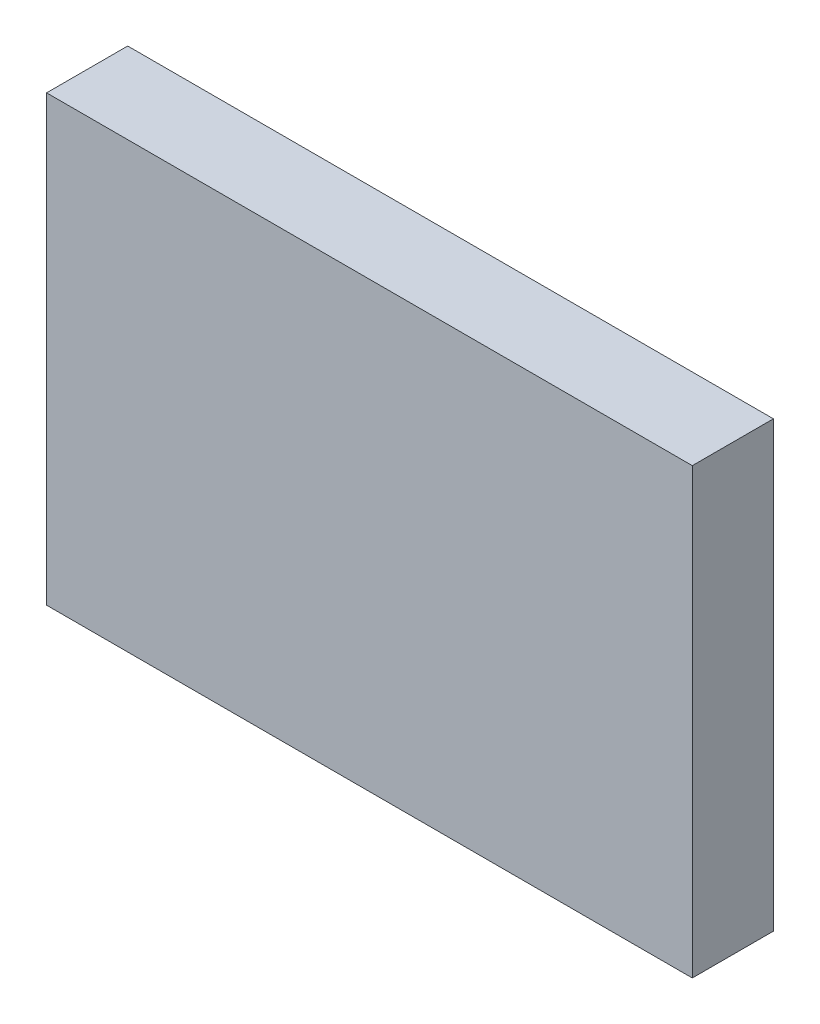
ISO-10303-21;
HEADER;
FILE_DESCRIPTION(('STEP AP214'),'2;1');
FILE_NAME('part.step','',(''),(''),'','','');
FILE_SCHEMA(('AUTOMOTIVE_DESIGN { 1 0 10303 214 1 1 1 1 }'));
ENDSEC;
DATA;
#1=APPLICATION_CONTEXT('core data for automotive mechanical design processes');
#2=APPLICATION_PROTOCOL_DEFINITION('international standard','automotive_design',2000,#1);
#3=PRODUCT_CONTEXT('',#1,'mechanical');
#4=PRODUCT('Part','Part','',(#3));
#5=PRODUCT_RELATED_PRODUCT_CATEGORY('part','',(#4));
#6=PRODUCT_DEFINITION_FORMATION('','',#4);
#7=PRODUCT_DEFINITION_CONTEXT('part definition',#1,'design');
#8=PRODUCT_DEFINITION('design','',#6,#7);
#9=PRODUCT_DEFINITION_SHAPE('','',#8);
#10=(LENGTH_UNIT() NAMED_UNIT(*) SI_UNIT(.MILLI.,.METRE.));
#11=(NAMED_UNIT(*) PLANE_ANGLE_UNIT() SI_UNIT($,.RADIAN.));
#12=(NAMED_UNIT(*) SI_UNIT($,.STERADIAN.) SOLID_ANGLE_UNIT());
#13=UNCERTAINTY_MEASURE_WITH_UNIT(LENGTH_MEASURE(1.E-05),#10,'distance_accuracy_value','');
#14=(GEOMETRIC_REPRESENTATION_CONTEXT(3) GLOBAL_UNCERTAINTY_ASSIGNED_CONTEXT((#13)) GLOBAL_UNIT_ASSIGNED_CONTEXT((#10,
#11,#12)) REPRESENTATION_CONTEXT('',''));
#15=CARTESIAN_POINT('',(0.,0.,0.));
#16=DIRECTION('',(0.,0.,1.));
#17=DIRECTION('',(1.,0.,0.));
#18=AXIS2_PLACEMENT_3D('',#15,#16,#17);
#19=CARTESIAN_POINT('',(-1.549,-0.597,0.));
#20=DIRECTION('',(0.,-1.,0.));
#21=DIRECTION('',(0.,0.,-1.));
#22=AXIS2_PLACEMENT_3D('',#19,#20,#21);
#23=PLANE('',#22);
#24=DIRECTION('',(-1.,0.,0.));
#25=VECTOR('',#24,1.);
#26=CARTESIAN_POINT('',(-1.143,-0.597,0.));
#27=LINE('',#26,#25);
#28=CARTESIAN_POINT('',(-1.143,-0.597,0.));
#29=VERTEX_POINT('',#28);
#30=CARTESIAN_POINT('',(-1.549,-0.597,0.));
#31=VERTEX_POINT('',#30);
#32=EDGE_CURVE('E11',#29,#31,#27,.T.);
#33=ORIENTED_EDGE('',*,*,#32,.F.);
#34=DIRECTION('',(0.,0.,-1.));
#35=VECTOR('',#34,1.);
#36=CARTESIAN_POINT('',(-1.143,-0.597,0.051));
#37=LINE('',#36,#35);
#38=CARTESIAN_POINT('',(-1.143,-0.597,0.051));
#39=VERTEX_POINT('',#38);
#40=EDGE_CURVE('E24',#39,#29,#37,.T.);
#41=ORIENTED_EDGE('',*,*,#40,.F.);
#42=DIRECTION('',(1.,0.,0.));
#43=VECTOR('',#42,1.);
#44=CARTESIAN_POINT('',(-1.549,-0.597,0.051));
#45=LINE('',#44,#43);
#46=CARTESIAN_POINT('',(-1.549,-0.597,0.051));
#47=VERTEX_POINT('',#46);
#48=EDGE_CURVE('E88',#47,#39,#45,.T.);
#49=ORIENTED_EDGE('',*,*,#48,.F.);
#50=DIRECTION('',(0.,0.,1.));
#51=VECTOR('',#50,1.);
#52=CARTESIAN_POINT('',(-1.549,-0.597,0.));
#53=LINE('',#52,#51);
#54=EDGE_CURVE('E77',#31,#47,#53,.T.);
#55=ORIENTED_EDGE('',*,*,#54,.F.);
#56=EDGE_LOOP('',(#33,#41,#49,#55));
#57=FACE_BOUND('',#56,.T.);
#58=ADVANCED_FACE('F17',(#57),#23,.T.);
#59=CARTESIAN_POINT('',(-1.143,-0.597,0.));
#60=DIRECTION('',(1.,0.,0.));
#61=DIRECTION('',(0.,1.,0.));
#62=AXIS2_PLACEMENT_3D('',#59,#60,#61);
#63=PLANE('',#62);
#64=DIRECTION('',(0.,-1.,0.));
#65=VECTOR('',#64,1.);
#66=CARTESIAN_POINT('',(-1.143,-0.318,0.));
#67=LINE('',#66,#65);
#68=CARTESIAN_POINT('',(-1.143,-0.318,0.));
#69=VERTEX_POINT('',#68);
#70=EDGE_CURVE('E85',#69,#29,#67,.T.);
#71=ORIENTED_EDGE('',*,*,#70,.F.);
#72=DIRECTION('',(0.,0.,-1.));
#73=VECTOR('',#72,1.);
#74=CARTESIAN_POINT('',(-1.143,-0.318,0.051));
#75=LINE('',#74,#73);
#76=CARTESIAN_POINT('',(-1.143,-0.318,0.051));
#77=VERTEX_POINT('',#76);
#78=EDGE_CURVE('E83',#77,#69,#75,.T.);
#79=ORIENTED_EDGE('',*,*,#78,.F.);
#80=DIRECTION('',(0.,1.,0.));
#81=VECTOR('',#80,1.);
#82=CARTESIAN_POINT('',(-1.143,-0.597,0.051));
#83=LINE('',#82,#81);
#84=EDGE_CURVE('E72',#39,#77,#83,.T.);
#85=ORIENTED_EDGE('',*,*,#84,.F.);
#86=ORIENTED_EDGE('',*,*,#40,.T.);
#87=EDGE_LOOP('',(#71,#79,#85,#86));
#88=FACE_BOUND('',#87,.T.);
#89=ADVANCED_FACE('F90',(#88),#63,.T.);
#90=CARTESIAN_POINT('',(-1.143,-0.318,0.));
#91=DIRECTION('',(0.,1.,0.));
#92=DIRECTION('',(1.,0.,0.));
#93=AXIS2_PLACEMENT_3D('',#90,#91,#92);
#94=PLANE('',#93);
#95=DIRECTION('',(1.,0.,0.));
#96=VECTOR('',#95,1.);
#97=CARTESIAN_POINT('',(-1.549,-0.318,0.));
#98=LINE('',#97,#96);
#99=CARTESIAN_POINT('',(-1.549,-0.318,0.));
#100=VERTEX_POINT('',#99);
#101=EDGE_CURVE('E60',#100,#69,#98,.T.);
#102=ORIENTED_EDGE('',*,*,#101,.F.);
#103=DIRECTION('',(0.,0.,-1.));
#104=VECTOR('',#103,1.);
#105=CARTESIAN_POINT('',(-1.549,-0.318,0.051));
#106=LINE('',#105,#104);
#107=CARTESIAN_POINT('',(-1.549,-0.318,0.051));
#108=VERTEX_POINT('',#107);
#109=EDGE_CURVE('E54',#108,#100,#106,.T.);
#110=ORIENTED_EDGE('',*,*,#109,.F.);
#111=DIRECTION('',(-1.,0.,0.));
#112=VECTOR('',#111,1.);
#113=CARTESIAN_POINT('',(-1.143,-0.318,0.051));
#114=LINE('',#113,#112);
#115=EDGE_CURVE('E58',#77,#108,#114,.T.);
#116=ORIENTED_EDGE('',*,*,#115,.F.);
#117=ORIENTED_EDGE('',*,*,#78,.T.);
#118=EDGE_LOOP('',(#102,#110,#116,#117));
#119=FACE_BOUND('',#118,.T.);
#120=ADVANCED_FACE('F56',(#119),#94,.T.);
#121=CARTESIAN_POINT('',(-1.549,-0.318,0.));
#122=DIRECTION('',(-1.,0.,0.));
#123=DIRECTION('',(0.,0.,1.));
#124=AXIS2_PLACEMENT_3D('',#121,#122,#123);
#125=PLANE('',#124);
#126=DIRECTION('',(0.,1.,0.));
#127=VECTOR('',#126,1.);
#128=CARTESIAN_POINT('',(-1.549,-0.597,0.));
#129=LINE('',#128,#127);
#130=EDGE_CURVE('E73',#31,#100,#129,.T.);
#131=ORIENTED_EDGE('',*,*,#130,.F.);
#132=ORIENTED_EDGE('',*,*,#54,.T.);
#133=DIRECTION('',(0.,-1.,0.));
#134=VECTOR('',#133,1.);
#135=CARTESIAN_POINT('',(-1.549,-0.318,0.051));
#136=LINE('',#135,#134);
#137=EDGE_CURVE('E70',#108,#47,#136,.T.);
#138=ORIENTED_EDGE('',*,*,#137,.F.);
#139=ORIENTED_EDGE('',*,*,#109,.T.);
#140=EDGE_LOOP('',(#131,#132,#138,#139));
#141=FACE_BOUND('',#140,.T.);
#142=ADVANCED_FACE('F76',(#141),#125,.T.);
#143=CARTESIAN_POINT('',(-1.549,-0.318,0.));
#144=DIRECTION('',(0.,0.,-1.));
#145=DIRECTION('',(0.,-1.,0.));
#146=AXIS2_PLACEMENT_3D('',#143,#144,#145);
#147=PLANE('',#146);
#148=ORIENTED_EDGE('',*,*,#101,.T.);
#149=ORIENTED_EDGE('',*,*,#70,.T.);
#150=ORIENTED_EDGE('',*,*,#32,.T.);
#151=ORIENTED_EDGE('',*,*,#130,.T.);
#152=EDGE_LOOP('',(#148,#149,#150,#151));
#153=FACE_BOUND('',#152,.T.);
#154=ADVANCED_FACE('F91',(#153),#147,.T.);
#155=CARTESIAN_POINT('',(-1.549,-0.597,0.051));
#156=DIRECTION('',(0.,0.,1.));
#157=DIRECTION('',(1.,0.,0.));
#158=AXIS2_PLACEMENT_3D('',#155,#156,#157);
#159=PLANE('',#158);
#160=ORIENTED_EDGE('',*,*,#48,.T.);
#161=ORIENTED_EDGE('',*,*,#84,.T.);
#162=ORIENTED_EDGE('',*,*,#115,.T.);
#163=ORIENTED_EDGE('',*,*,#137,.T.);
#164=EDGE_LOOP('',(#160,#161,#162,#163));
#165=FACE_BOUND('',#164,.T.);
#166=ADVANCED_FACE('F69',(#165),#159,.T.);
#167=CLOSED_SHELL('',(#58,#89,#120,#142,#154,#166));
#168=MANIFOLD_SOLID_BREP('B1',#167);
#169=ADVANCED_BREP_SHAPE_REPRESENTATION('',(#18,#168),#14);
#170=SHAPE_DEFINITION_REPRESENTATION(#9,#169);
ENDSEC;
END-ISO-10303-21;
